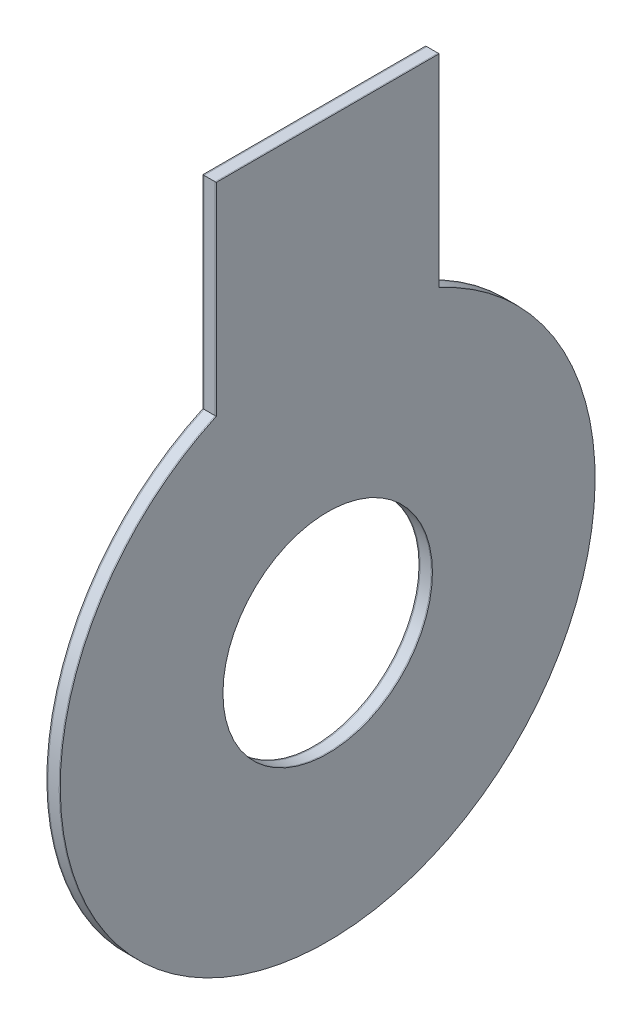
ISO-10303-21;
HEADER;
FILE_DESCRIPTION(('STEP AP214'),'2;1');
FILE_NAME('part.step','',(''),(''),'','','');
FILE_SCHEMA(('AUTOMOTIVE_DESIGN { 1 0 10303 214 1 1 1 1 }'));
ENDSEC;
DATA;
#1=APPLICATION_CONTEXT('core data for automotive mechanical design processes');
#2=APPLICATION_PROTOCOL_DEFINITION('international standard','automotive_design',2000,#1);
#3=PRODUCT_CONTEXT('',#1,'mechanical');
#4=PRODUCT('Part','Part','',(#3));
#5=PRODUCT_RELATED_PRODUCT_CATEGORY('part','',(#4));
#6=PRODUCT_DEFINITION_FORMATION('','',#4);
#7=PRODUCT_DEFINITION_CONTEXT('part definition',#1,'design');
#8=PRODUCT_DEFINITION('design','',#6,#7);
#9=PRODUCT_DEFINITION_SHAPE('','',#8);
#10=(LENGTH_UNIT() NAMED_UNIT(*) SI_UNIT(.MILLI.,.METRE.));
#11=(NAMED_UNIT(*) PLANE_ANGLE_UNIT() SI_UNIT($,.RADIAN.));
#12=(NAMED_UNIT(*) SI_UNIT($,.STERADIAN.) SOLID_ANGLE_UNIT());
#13=UNCERTAINTY_MEASURE_WITH_UNIT(LENGTH_MEASURE(1.E-05),#10,'distance_accuracy_value','');
#14=(GEOMETRIC_REPRESENTATION_CONTEXT(3) GLOBAL_UNCERTAINTY_ASSIGNED_CONTEXT((#13)) GLOBAL_UNIT_ASSIGNED_CONTEXT((#10,
#11,#12)) REPRESENTATION_CONTEXT('',''));
#15=CARTESIAN_POINT('',(0.,0.,0.));
#16=DIRECTION('',(0.,0.,1.));
#17=DIRECTION('',(1.,0.,0.));
#18=AXIS2_PLACEMENT_3D('',#15,#16,#17);
#19=CARTESIAN_POINT('',(-2.75,0.,0.));
#20=DIRECTION('',(-1.,0.,0.));
#21=DIRECTION('',(0.,0.,1.));
#22=AXIS2_PLACEMENT_3D('',#19,#20,#21);
#23=PLANE('',#22);
#24=CARTESIAN_POINT('',(-2.75,0.,0.));
#25=DIRECTION('',(-1.,0.,0.));
#26=DIRECTION('',(0.,0.,1.));
#27=AXIS2_PLACEMENT_3D('',#24,#25,#26);
#28=CIRCLE('',#27,60.);
#29=CARTESIAN_POINT('',(-2.75,54.5435605731786,-25.));
#30=VERTEX_POINT('',#29);
#31=CARTESIAN_POINT('',(-2.75,54.5435605731786,25.));
#32=VERTEX_POINT('',#31);
#33=EDGE_CURVE('E108',#30,#32,#28,.T.);
#34=ORIENTED_EDGE('',*,*,#33,.T.);
#35=DIRECTION('',(0.,1.,0.));
#36=VECTOR('',#35,1.);
#37=CARTESIAN_POINT('',(-2.75,54.5435605731786,25.));
#38=LINE('',#37,#36);
#39=CARTESIAN_POINT('',(-2.75,100.,25.));
#40=VERTEX_POINT('',#39);
#41=EDGE_CURVE('E103',#32,#40,#38,.T.);
#42=ORIENTED_EDGE('',*,*,#41,.T.);
#43=DIRECTION('',(0.,0.,-1.));
#44=VECTOR('',#43,1.);
#45=CARTESIAN_POINT('',(-2.75,100.,25.));
#46=LINE('',#45,#44);
#47=CARTESIAN_POINT('',(-2.75,100.,-25.));
#48=VERTEX_POINT('',#47);
#49=EDGE_CURVE('E106',#40,#48,#46,.T.);
#50=ORIENTED_EDGE('',*,*,#49,.T.);
#51=DIRECTION('',(0.,-1.,0.));
#52=VECTOR('',#51,1.);
#53=CARTESIAN_POINT('',(-2.75,100.,-25.));
#54=LINE('',#53,#52);
#55=EDGE_CURVE('E73',#48,#30,#54,.T.);
#56=ORIENTED_EDGE('',*,*,#55,.T.);
#57=EDGE_LOOP('',(#34,#42,#50,#56));
#58=FACE_BOUND('',#57,.T.);
#59=CARTESIAN_POINT('',(-2.75,0.,0.));
#60=DIRECTION('',(-1.,0.,0.));
#61=DIRECTION('',(0.,0.,1.));
#62=AXIS2_PLACEMENT_3D('',#59,#60,#61);
#63=CIRCLE('',#62,23.5);
#64=CARTESIAN_POINT('',(-2.75,0.,23.5));
#65=VERTEX_POINT('',#64);
#66=EDGE_CURVE('E123',#65,#65,#63,.T.);
#67=ORIENTED_EDGE('',*,*,#66,.F.);
#68=EDGE_LOOP('',(#67));
#69=FACE_BOUND('',#68,.T.);
#70=ADVANCED_FACE('F56',(#58,#69),#23,.T.);
#71=CARTESIAN_POINT('',(-2.5,0.,0.));
#72=DIRECTION('',(-1.,0.,0.));
#73=DIRECTION('',(0.,0.,1.));
#74=AXIS2_PLACEMENT_3D('',#71,#72,#73);
#75=PLANE('',#74);
#76=CARTESIAN_POINT('',(-2.5,0.,0.));
#77=DIRECTION('',(-1.,0.,0.));
#78=DIRECTION('',(0.,0.,1.));
#79=AXIS2_PLACEMENT_3D('',#76,#77,#78);
#80=CIRCLE('',#79,60.);
#81=CARTESIAN_POINT('',(-2.5,54.5435605731786,-25.));
#82=VERTEX_POINT('',#81);
#83=CARTESIAN_POINT('',(-2.5,54.5435605731786,25.));
#84=VERTEX_POINT('',#83);
#85=EDGE_CURVE('E120',#82,#84,#80,.T.);
#86=ORIENTED_EDGE('',*,*,#85,.F.);
#87=DIRECTION('',(0.,-1.,0.));
#88=VECTOR('',#87,1.);
#89=CARTESIAN_POINT('',(-2.5,100.,-25.));
#90=LINE('',#89,#88);
#91=CARTESIAN_POINT('',(-2.5,100.,-25.));
#92=VERTEX_POINT('',#91);
#93=EDGE_CURVE('E96',#92,#82,#90,.T.);
#94=ORIENTED_EDGE('',*,*,#93,.F.);
#95=DIRECTION('',(0.,0.,-1.));
#96=VECTOR('',#95,1.);
#97=CARTESIAN_POINT('',(-2.5,100.,25.));
#98=LINE('',#97,#96);
#99=CARTESIAN_POINT('',(-2.5,100.,25.));
#100=VERTEX_POINT('',#99);
#101=EDGE_CURVE('E90',#100,#92,#98,.T.);
#102=ORIENTED_EDGE('',*,*,#101,.F.);
#103=DIRECTION('',(0.,1.,0.));
#104=VECTOR('',#103,1.);
#105=CARTESIAN_POINT('',(-2.5,54.5435605731786,25.));
#106=LINE('',#105,#104);
#107=EDGE_CURVE('E112',#84,#100,#106,.T.);
#108=ORIENTED_EDGE('',*,*,#107,.F.);
#109=EDGE_LOOP('',(#86,#94,#102,#108));
#110=FACE_BOUND('',#109,.T.);
#111=CARTESIAN_POINT('',(-2.5,0.,0.));
#112=DIRECTION('',(-1.,0.,0.));
#113=DIRECTION('',(0.,0.,1.));
#114=AXIS2_PLACEMENT_3D('',#111,#112,#113);
#115=CIRCLE('',#114,23.5);
#116=CARTESIAN_POINT('',(-2.5,0.,23.5));
#117=VERTEX_POINT('',#116);
#118=EDGE_CURVE('E135',#117,#117,#115,.T.);
#119=ORIENTED_EDGE('',*,*,#118,.T.);
#120=EDGE_LOOP('',(#119));
#121=FACE_BOUND('',#120,.T.);
#122=ADVANCED_FACE('F131',(#110,#121),#75,.F.);
#123=CARTESIAN_POINT('',(-2.75,0.,0.));
#124=DIRECTION('',(1.,0.,0.));
#125=DIRECTION('',(0.,0.,-1.));
#126=AXIS2_PLACEMENT_3D('',#123,#124,#125);
#127=CYLINDRICAL_SURFACE('',#126,60.);
#128=ORIENTED_EDGE('',*,*,#85,.T.);
#129=DIRECTION('',(1.,0.,0.));
#130=VECTOR('',#129,1.);
#131=CARTESIAN_POINT('',(-2.75,54.5435605731786,25.));
#132=LINE('',#131,#130);
#133=EDGE_CURVE('E12',#32,#84,#132,.T.);
#134=ORIENTED_EDGE('',*,*,#133,.F.);
#135=ORIENTED_EDGE('',*,*,#33,.F.);
#136=DIRECTION('',(1.,0.,0.));
#137=VECTOR('',#136,1.);
#138=CARTESIAN_POINT('',(-2.75,54.5435605731786,-25.));
#139=LINE('',#138,#137);
#140=EDGE_CURVE('E116',#30,#82,#139,.T.);
#141=ORIENTED_EDGE('',*,*,#140,.T.);
#142=EDGE_LOOP('',(#128,#134,#135,#141));
#143=FACE_BOUND('',#142,.T.);
#144=ADVANCED_FACE('F58',(#143),#127,.T.);
#145=CARTESIAN_POINT('',(-2.75,54.5435605731786,25.));
#146=DIRECTION('',(0.,0.,-1.));
#147=DIRECTION('',(0.,1.,0.));
#148=AXIS2_PLACEMENT_3D('',#145,#146,#147);
#149=PLANE('',#148);
#150=ORIENTED_EDGE('',*,*,#107,.T.);
#151=DIRECTION('',(1.,0.,0.));
#152=VECTOR('',#151,1.);
#153=CARTESIAN_POINT('',(-2.75,100.,25.));
#154=LINE('',#153,#152);
#155=EDGE_CURVE('E65',#40,#100,#154,.T.);
#156=ORIENTED_EDGE('',*,*,#155,.F.);
#157=ORIENTED_EDGE('',*,*,#41,.F.);
#158=ORIENTED_EDGE('',*,*,#133,.T.);
#159=EDGE_LOOP('',(#150,#156,#157,#158));
#160=FACE_BOUND('',#159,.T.);
#161=ADVANCED_FACE('F111',(#160),#149,.F.);
#162=CARTESIAN_POINT('',(-2.75,100.,25.));
#163=DIRECTION('',(0.,-1.,0.));
#164=DIRECTION('',(0.,0.,-1.));
#165=AXIS2_PLACEMENT_3D('',#162,#163,#164);
#166=PLANE('',#165);
#167=ORIENTED_EDGE('',*,*,#101,.T.);
#168=DIRECTION('',(1.,0.,0.));
#169=VECTOR('',#168,1.);
#170=CARTESIAN_POINT('',(-2.75,100.,-25.));
#171=LINE('',#170,#169);
#172=EDGE_CURVE('E113',#48,#92,#171,.T.);
#173=ORIENTED_EDGE('',*,*,#172,.F.);
#174=ORIENTED_EDGE('',*,*,#49,.F.);
#175=ORIENTED_EDGE('',*,*,#155,.T.);
#176=EDGE_LOOP('',(#167,#173,#174,#175));
#177=FACE_BOUND('',#176,.T.);
#178=ADVANCED_FACE('F114',(#177),#166,.F.);
#179=CARTESIAN_POINT('',(-2.75,100.,-25.));
#180=DIRECTION('',(0.,0.,1.));
#181=DIRECTION('',(0.,-1.,0.));
#182=AXIS2_PLACEMENT_3D('',#179,#180,#181);
#183=PLANE('',#182);
#184=ORIENTED_EDGE('',*,*,#93,.T.);
#185=ORIENTED_EDGE('',*,*,#140,.F.);
#186=ORIENTED_EDGE('',*,*,#55,.F.);
#187=ORIENTED_EDGE('',*,*,#172,.T.);
#188=EDGE_LOOP('',(#184,#185,#186,#187));
#189=FACE_BOUND('',#188,.T.);
#190=ADVANCED_FACE('F128',(#189),#183,.F.);
#191=CARTESIAN_POINT('',(-2.75,0.,0.));
#192=DIRECTION('',(1.,0.,0.));
#193=DIRECTION('',(0.,0.,-1.));
#194=AXIS2_PLACEMENT_3D('',#191,#192,#193);
#195=CYLINDRICAL_SURFACE('',#194,23.5);
#196=ORIENTED_EDGE('',*,*,#66,.T.);
#197=EDGE_LOOP('',(#196));
#198=FACE_BOUND('',#197,.T.);
#199=ORIENTED_EDGE('',*,*,#118,.F.);
#200=EDGE_LOOP('',(#199));
#201=FACE_BOUND('',#200,.T.);
#202=ADVANCED_FACE('F141',(#198,#201),#195,.F.);
#203=CLOSED_SHELL('',(#70,#122,#144,#161,#178,#190,#202));
#204=MANIFOLD_SOLID_BREP('B2',#203);
#205=CARTESIAN_POINT('',(-2.5,0.,0.));
#206=DIRECTION('',(-1.,0.,0.));
#207=DIRECTION('',(0.,0.,1.));
#208=AXIS2_PLACEMENT_3D('',#205,#206,#207);
#209=PLANE('',#208);
#210=CARTESIAN_POINT('',(-2.5,0.,0.));
#211=DIRECTION('',(-1.,0.,0.));
#212=DIRECTION('',(0.,0.,1.));
#213=AXIS2_PLACEMENT_3D('',#210,#211,#212);
#214=CIRCLE('',#213,60.);
#215=CARTESIAN_POINT('',(-2.5,54.5435605731786,-25.));
#216=VERTEX_POINT('',#215);
#217=CARTESIAN_POINT('',(-2.5,54.5435605731786,25.));
#218=VERTEX_POINT('',#217);
#219=EDGE_CURVE('E262',#216,#218,#214,.T.);
#220=ORIENTED_EDGE('',*,*,#219,.T.);
#221=DIRECTION('',(0.,1.,0.));
#222=VECTOR('',#221,1.);
#223=CARTESIAN_POINT('',(-2.5,54.5435605731786,25.));
#224=LINE('',#223,#222);
#225=CARTESIAN_POINT('',(-2.5,100.,25.));
#226=VERTEX_POINT('',#225);
#227=EDGE_CURVE('E257',#218,#226,#224,.T.);
#228=ORIENTED_EDGE('',*,*,#227,.T.);
#229=DIRECTION('',(0.,0.,-1.));
#230=VECTOR('',#229,1.);
#231=CARTESIAN_POINT('',(-2.5,100.,25.));
#232=LINE('',#231,#230);
#233=CARTESIAN_POINT('',(-2.5,100.,-25.));
#234=VERTEX_POINT('',#233);
#235=EDGE_CURVE('E260',#226,#234,#232,.T.);
#236=ORIENTED_EDGE('',*,*,#235,.T.);
#237=DIRECTION('',(0.,-1.,0.));
#238=VECTOR('',#237,1.);
#239=CARTESIAN_POINT('',(-2.5,100.,-25.));
#240=LINE('',#239,#238);
#241=EDGE_CURVE('E227',#234,#216,#240,.T.);
#242=ORIENTED_EDGE('',*,*,#241,.T.);
#243=EDGE_LOOP('',(#220,#228,#236,#242));
#244=FACE_BOUND('',#243,.T.);
#245=CARTESIAN_POINT('',(-2.5,0.,0.));
#246=DIRECTION('',(-1.,0.,0.));
#247=DIRECTION('',(0.,0.,1.));
#248=AXIS2_PLACEMENT_3D('',#245,#246,#247);
#249=CIRCLE('',#248,23.5);
#250=CARTESIAN_POINT('',(-2.5,0.,23.5));
#251=VERTEX_POINT('',#250);
#252=EDGE_CURVE('E277',#251,#251,#249,.T.);
#253=ORIENTED_EDGE('',*,*,#252,.F.);
#254=EDGE_LOOP('',(#253));
#255=FACE_BOUND('',#254,.T.);
#256=ADVANCED_FACE('F210',(#244,#255),#209,.T.);
#257=CARTESIAN_POINT('',(0.,0.,0.));
#258=DIRECTION('',(-1.,0.,0.));
#259=DIRECTION('',(0.,0.,1.));
#260=AXIS2_PLACEMENT_3D('',#257,#258,#259);
#261=PLANE('',#260);
#262=CARTESIAN_POINT('',(0.,0.,0.));
#263=DIRECTION('',(-1.,0.,0.));
#264=DIRECTION('',(0.,0.,1.));
#265=AXIS2_PLACEMENT_3D('',#262,#263,#264);
#266=CIRCLE('',#265,60.);
#267=CARTESIAN_POINT('',(0.,54.5435605731786,-25.));
#268=VERTEX_POINT('',#267);
#269=CARTESIAN_POINT('',(0.,54.5435605731786,25.));
#270=VERTEX_POINT('',#269);
#271=EDGE_CURVE('E274',#268,#270,#266,.T.);
#272=ORIENTED_EDGE('',*,*,#271,.F.);
#273=DIRECTION('',(0.,-1.,0.));
#274=VECTOR('',#273,1.);
#275=CARTESIAN_POINT('',(0.,100.,-25.));
#276=LINE('',#275,#274);
#277=CARTESIAN_POINT('',(0.,100.,-25.));
#278=VERTEX_POINT('',#277);
#279=EDGE_CURVE('E250',#278,#268,#276,.T.);
#280=ORIENTED_EDGE('',*,*,#279,.F.);
#281=DIRECTION('',(0.,0.,-1.));
#282=VECTOR('',#281,1.);
#283=CARTESIAN_POINT('',(0.,100.,25.));
#284=LINE('',#283,#282);
#285=CARTESIAN_POINT('',(0.,100.,25.));
#286=VERTEX_POINT('',#285);
#287=EDGE_CURVE('E244',#286,#278,#284,.T.);
#288=ORIENTED_EDGE('',*,*,#287,.F.);
#289=DIRECTION('',(0.,1.,0.));
#290=VECTOR('',#289,1.);
#291=CARTESIAN_POINT('',(0.,54.5435605731786,25.));
#292=LINE('',#291,#290);
#293=EDGE_CURVE('E266',#270,#286,#292,.T.);
#294=ORIENTED_EDGE('',*,*,#293,.F.);
#295=EDGE_LOOP('',(#272,#280,#288,#294));
#296=FACE_BOUND('',#295,.T.);
#297=CARTESIAN_POINT('',(0.,0.,0.));
#298=DIRECTION('',(-1.,0.,0.));
#299=DIRECTION('',(0.,0.,1.));
#300=AXIS2_PLACEMENT_3D('',#297,#298,#299);
#301=CIRCLE('',#300,23.5);
#302=CARTESIAN_POINT('',(0.,0.,23.5));
#303=VERTEX_POINT('',#302);
#304=EDGE_CURVE('E289',#303,#303,#301,.T.);
#305=ORIENTED_EDGE('',*,*,#304,.T.);
#306=EDGE_LOOP('',(#305));
#307=FACE_BOUND('',#306,.T.);
#308=ADVANCED_FACE('F285',(#296,#307),#261,.F.);
#309=CARTESIAN_POINT('',(-2.5,0.,0.));
#310=DIRECTION('',(1.,0.,0.));
#311=DIRECTION('',(0.,0.,-1.));
#312=AXIS2_PLACEMENT_3D('',#309,#310,#311);
#313=CYLINDRICAL_SURFACE('',#312,60.);
#314=ORIENTED_EDGE('',*,*,#271,.T.);
#315=DIRECTION('',(1.,0.,0.));
#316=VECTOR('',#315,1.);
#317=CARTESIAN_POINT('',(-2.5,54.5435605731786,25.));
#318=LINE('',#317,#316);
#319=EDGE_CURVE('E54',#218,#270,#318,.T.);
#320=ORIENTED_EDGE('',*,*,#319,.F.);
#321=ORIENTED_EDGE('',*,*,#219,.F.);
#322=DIRECTION('',(1.,0.,0.));
#323=VECTOR('',#322,1.);
#324=CARTESIAN_POINT('',(-2.5,54.5435605731786,-25.));
#325=LINE('',#324,#323);
#326=EDGE_CURVE('E270',#216,#268,#325,.T.);
#327=ORIENTED_EDGE('',*,*,#326,.T.);
#328=EDGE_LOOP('',(#314,#320,#321,#327));
#329=FACE_BOUND('',#328,.T.);
#330=ADVANCED_FACE('F212',(#329),#313,.T.);
#331=CARTESIAN_POINT('',(-2.5,54.5435605731786,25.));
#332=DIRECTION('',(0.,0.,-1.));
#333=DIRECTION('',(0.,1.,0.));
#334=AXIS2_PLACEMENT_3D('',#331,#332,#333);
#335=PLANE('',#334);
#336=ORIENTED_EDGE('',*,*,#293,.T.);
#337=DIRECTION('',(1.,0.,0.));
#338=VECTOR('',#337,1.);
#339=CARTESIAN_POINT('',(-2.5,100.,25.));
#340=LINE('',#339,#338);
#341=EDGE_CURVE('E219',#226,#286,#340,.T.);
#342=ORIENTED_EDGE('',*,*,#341,.F.);
#343=ORIENTED_EDGE('',*,*,#227,.F.);
#344=ORIENTED_EDGE('',*,*,#319,.T.);
#345=EDGE_LOOP('',(#336,#342,#343,#344));
#346=FACE_BOUND('',#345,.T.);
#347=ADVANCED_FACE('F265',(#346),#335,.F.);
#348=CARTESIAN_POINT('',(-2.5,100.,25.));
#349=DIRECTION('',(0.,-1.,0.));
#350=DIRECTION('',(0.,0.,-1.));
#351=AXIS2_PLACEMENT_3D('',#348,#349,#350);
#352=PLANE('',#351);
#353=ORIENTED_EDGE('',*,*,#287,.T.);
#354=DIRECTION('',(1.,0.,0.));
#355=VECTOR('',#354,1.);
#356=CARTESIAN_POINT('',(-2.5,100.,-25.));
#357=LINE('',#356,#355);
#358=EDGE_CURVE('E267',#234,#278,#357,.T.);
#359=ORIENTED_EDGE('',*,*,#358,.F.);
#360=ORIENTED_EDGE('',*,*,#235,.F.);
#361=ORIENTED_EDGE('',*,*,#341,.T.);
#362=EDGE_LOOP('',(#353,#359,#360,#361));
#363=FACE_BOUND('',#362,.T.);
#364=ADVANCED_FACE('F268',(#363),#352,.F.);
#365=CARTESIAN_POINT('',(-2.5,100.,-25.));
#366=DIRECTION('',(0.,0.,1.));
#367=DIRECTION('',(0.,-1.,0.));
#368=AXIS2_PLACEMENT_3D('',#365,#366,#367);
#369=PLANE('',#368);
#370=ORIENTED_EDGE('',*,*,#279,.T.);
#371=ORIENTED_EDGE('',*,*,#326,.F.);
#372=ORIENTED_EDGE('',*,*,#241,.F.);
#373=ORIENTED_EDGE('',*,*,#358,.T.);
#374=EDGE_LOOP('',(#370,#371,#372,#373));
#375=FACE_BOUND('',#374,.T.);
#376=ADVANCED_FACE('F282',(#375),#369,.F.);
#377=CARTESIAN_POINT('',(-2.5,0.,0.));
#378=DIRECTION('',(1.,0.,0.));
#379=DIRECTION('',(0.,0.,-1.));
#380=AXIS2_PLACEMENT_3D('',#377,#378,#379);
#381=CYLINDRICAL_SURFACE('',#380,23.5);
#382=ORIENTED_EDGE('',*,*,#252,.T.);
#383=EDGE_LOOP('',(#382));
#384=FACE_BOUND('',#383,.T.);
#385=ORIENTED_EDGE('',*,*,#304,.F.);
#386=EDGE_LOOP('',(#385));
#387=FACE_BOUND('',#386,.T.);
#388=ADVANCED_FACE('F295',(#384,#387),#381,.F.);
#389=CLOSED_SHELL('',(#256,#308,#330,#347,#364,#376,#388));
#390=MANIFOLD_SOLID_BREP('B6',#389);
#391=CARTESIAN_POINT('',(0.25,0.,25.));
#392=DIRECTION('',(0.,0.,-1.));
#393=DIRECTION('',(0.,1.,0.));
#394=AXIS2_PLACEMENT_3D('',#391,#392,#393);
#395=PLANE('',#394);
#396=DIRECTION('',(0.,-1.,0.));
#397=VECTOR('',#396,1.);
#398=CARTESIAN_POINT('',(0.,0.,25.));
#399=LINE('',#398,#397);
#400=CARTESIAN_POINT('',(0.,100.,25.));
#401=VERTEX_POINT('',#400);
#402=CARTESIAN_POINT('',(0.,54.5435605731786,25.));
#403=VERTEX_POINT('',#402);
#404=EDGE_CURVE('E422',#401,#403,#399,.T.);
#405=ORIENTED_EDGE('',*,*,#404,.T.);
#406=DIRECTION('',(-1.,0.,0.));
#407=VECTOR('',#406,1.);
#408=CARTESIAN_POINT('',(0.25,54.5435605731786,25.));
#409=LINE('',#408,#407);
#410=CARTESIAN_POINT('',(0.25,54.5435605731786,25.));
#411=VERTEX_POINT('',#410);
#412=EDGE_CURVE('E208',#411,#403,#409,.T.);
#413=ORIENTED_EDGE('',*,*,#412,.F.);
#414=DIRECTION('',(0.,-1.,0.));
#415=VECTOR('',#414,1.);
#416=CARTESIAN_POINT('',(0.25,0.,25.));
#417=LINE('',#416,#415);
#418=CARTESIAN_POINT('',(0.25,100.,25.));
#419=VERTEX_POINT('',#418);
#420=EDGE_CURVE('E405',#419,#411,#417,.T.);
#421=ORIENTED_EDGE('',*,*,#420,.F.);
#422=DIRECTION('',(-1.,0.,0.));
#423=VECTOR('',#422,1.);
#424=CARTESIAN_POINT('',(0.25,100.,25.));
#425=LINE('',#424,#423);
#426=EDGE_CURVE('E371',#419,#401,#425,.T.);
#427=ORIENTED_EDGE('',*,*,#426,.T.);
#428=EDGE_LOOP('',(#405,#413,#421,#427));
#429=FACE_BOUND('',#428,.T.);
#430=ADVANCED_FACE('F355',(#429),#395,.F.);
#431=CARTESIAN_POINT('',(0.25,0.,0.));
#432=DIRECTION('',(-1.,0.,0.));
#433=DIRECTION('',(0.,0.,1.));
#434=AXIS2_PLACEMENT_3D('',#431,#432,#433);
#435=CYLINDRICAL_SURFACE('',#434,60.);
#436=CARTESIAN_POINT('',(0.,0.,0.));
#437=DIRECTION('',(1.,0.,0.));
#438=DIRECTION('',(0.,0.,-1.));
#439=AXIS2_PLACEMENT_3D('',#436,#437,#438);
#440=CIRCLE('',#439,60.);
#441=CARTESIAN_POINT('',(0.,54.5435605731786,-25.));
#442=VERTEX_POINT('',#441);
#443=EDGE_CURVE('E410',#403,#442,#440,.T.);
#444=ORIENTED_EDGE('',*,*,#443,.T.);
#445=DIRECTION('',(-1.,0.,0.));
#446=VECTOR('',#445,1.);
#447=CARTESIAN_POINT('',(0.25,54.5435605731786,-25.));
#448=LINE('',#447,#446);
#449=CARTESIAN_POINT('',(0.25,54.5435605731786,-25.));
#450=VERTEX_POINT('',#449);
#451=EDGE_CURVE('E363',#450,#442,#448,.T.);
#452=ORIENTED_EDGE('',*,*,#451,.F.);
#453=CARTESIAN_POINT('',(0.25,0.,0.));
#454=DIRECTION('',(1.,0.,0.));
#455=DIRECTION('',(0.,0.,-1.));
#456=AXIS2_PLACEMENT_3D('',#453,#454,#455);
#457=CIRCLE('',#456,60.);
#458=EDGE_CURVE('E396',#411,#450,#457,.T.);
#459=ORIENTED_EDGE('',*,*,#458,.F.);
#460=ORIENTED_EDGE('',*,*,#412,.T.);
#461=EDGE_LOOP('',(#444,#452,#459,#460));
#462=FACE_BOUND('',#461,.T.);
#463=ADVANCED_FACE('F409',(#462),#435,.T.);
#464=CARTESIAN_POINT('',(0.25,0.,-25.));
#465=DIRECTION('',(0.,0.,-1.));
#466=DIRECTION('',(0.,1.,0.));
#467=AXIS2_PLACEMENT_3D('',#464,#465,#466);
#468=PLANE('',#467);
#469=DIRECTION('',(0.,-1.,0.));
#470=VECTOR('',#469,1.);
#471=CARTESIAN_POINT('',(0.,0.,-25.));
#472=LINE('',#471,#470);
#473=CARTESIAN_POINT('',(0.,100.,-25.));
#474=VERTEX_POINT('',#473);
#475=EDGE_CURVE('E425',#474,#442,#472,.T.);
#476=ORIENTED_EDGE('',*,*,#475,.F.);
#477=DIRECTION('',(-1.,0.,0.));
#478=VECTOR('',#477,1.);
#479=CARTESIAN_POINT('',(0.25,100.,-25.));
#480=LINE('',#479,#478);
#481=CARTESIAN_POINT('',(0.25,100.,-25.));
#482=VERTEX_POINT('',#481);
#483=EDGE_CURVE('E385',#482,#474,#480,.T.);
#484=ORIENTED_EDGE('',*,*,#483,.F.);
#485=DIRECTION('',(0.,-1.,0.));
#486=VECTOR('',#485,1.);
#487=CARTESIAN_POINT('',(0.25,0.,-25.));
#488=LINE('',#487,#486);
#489=EDGE_CURVE('E404',#482,#450,#488,.T.);
#490=ORIENTED_EDGE('',*,*,#489,.T.);
#491=ORIENTED_EDGE('',*,*,#451,.T.);
#492=EDGE_LOOP('',(#476,#484,#490,#491));
#493=FACE_BOUND('',#492,.T.);
#494=ADVANCED_FACE('F413',(#493),#468,.T.);
#495=CARTESIAN_POINT('',(0.25,100.,0.));
#496=DIRECTION('',(0.,1.,0.));
#497=DIRECTION('',(0.,0.,1.));
#498=AXIS2_PLACEMENT_3D('',#495,#496,#497);
#499=PLANE('',#498);
#500=DIRECTION('',(0.,0.,-1.));
#501=VECTOR('',#500,1.);
#502=CARTESIAN_POINT('',(0.,100.,0.));
#503=LINE('',#502,#501);
#504=EDGE_CURVE('E427',#401,#474,#503,.T.);
#505=ORIENTED_EDGE('',*,*,#504,.F.);
#506=ORIENTED_EDGE('',*,*,#426,.F.);
#507=DIRECTION('',(0.,0.,-1.));
#508=VECTOR('',#507,1.);
#509=CARTESIAN_POINT('',(0.25,100.,0.));
#510=LINE('',#509,#508);
#511=EDGE_CURVE('E414',#419,#482,#510,.T.);
#512=ORIENTED_EDGE('',*,*,#511,.T.);
#513=ORIENTED_EDGE('',*,*,#483,.T.);
#514=EDGE_LOOP('',(#505,#506,#512,#513));
#515=FACE_BOUND('',#514,.T.);
#516=ADVANCED_FACE('F440',(#515),#499,.T.);
#517=CARTESIAN_POINT('',(0.25,0.,0.));
#518=DIRECTION('',(-1.,0.,0.));
#519=DIRECTION('',(0.,0.,1.));
#520=AXIS2_PLACEMENT_3D('',#517,#518,#519);
#521=CYLINDRICAL_SURFACE('',#520,23.5);
#522=CARTESIAN_POINT('',(0.25,0.,0.));
#523=DIRECTION('',(1.,0.,0.));
#524=DIRECTION('',(0.,0.,-1.));
#525=AXIS2_PLACEMENT_3D('',#522,#523,#524);
#526=CIRCLE('',#525,23.5);
#527=CARTESIAN_POINT('',(0.25,0.,-23.5));
#528=VERTEX_POINT('',#527);
#529=EDGE_CURVE('E416',#528,#528,#526,.T.);
#530=ORIENTED_EDGE('',*,*,#529,.T.);
#531=EDGE_LOOP('',(#530));
#532=FACE_BOUND('',#531,.T.);
#533=CARTESIAN_POINT('',(0.,0.,0.));
#534=DIRECTION('',(1.,0.,0.));
#535=DIRECTION('',(0.,0.,-1.));
#536=AXIS2_PLACEMENT_3D('',#533,#534,#535);
#537=CIRCLE('',#536,23.5);
#538=CARTESIAN_POINT('',(0.,0.,-23.5));
#539=VERTEX_POINT('',#538);
#540=EDGE_CURVE('E430',#539,#539,#537,.T.);
#541=ORIENTED_EDGE('',*,*,#540,.F.);
#542=EDGE_LOOP('',(#541));
#543=FACE_BOUND('',#542,.T.);
#544=ADVANCED_FACE('F438',(#532,#543),#521,.F.);
#545=CARTESIAN_POINT('',(0.25,0.,0.));
#546=DIRECTION('',(1.,0.,0.));
#547=DIRECTION('',(0.,0.,-1.));
#548=AXIS2_PLACEMENT_3D('',#545,#546,#547);
#549=PLANE('',#548);
#550=ORIENTED_EDGE('',*,*,#420,.T.);
#551=ORIENTED_EDGE('',*,*,#458,.T.);
#552=ORIENTED_EDGE('',*,*,#489,.F.);
#553=ORIENTED_EDGE('',*,*,#511,.F.);
#554=EDGE_LOOP('',(#550,#551,#552,#553));
#555=FACE_BOUND('',#554,.T.);
#556=ORIENTED_EDGE('',*,*,#529,.F.);
#557=EDGE_LOOP('',(#556));
#558=FACE_BOUND('',#557,.T.);
#559=ADVANCED_FACE('F400',(#555,#558),#549,.T.);
#560=CARTESIAN_POINT('',(0.,0.,0.));
#561=DIRECTION('',(1.,0.,0.));
#562=DIRECTION('',(0.,0.,-1.));
#563=AXIS2_PLACEMENT_3D('',#560,#561,#562);
#564=PLANE('',#563);
#565=ORIENTED_EDGE('',*,*,#404,.F.);
#566=ORIENTED_EDGE('',*,*,#504,.T.);
#567=ORIENTED_EDGE('',*,*,#475,.T.);
#568=ORIENTED_EDGE('',*,*,#443,.F.);
#569=EDGE_LOOP('',(#565,#566,#567,#568));
#570=FACE_BOUND('',#569,.T.);
#571=ORIENTED_EDGE('',*,*,#540,.T.);
#572=EDGE_LOOP('',(#571));
#573=FACE_BOUND('',#572,.T.);
#574=ADVANCED_FACE('F436',(#570,#573),#564,.F.);
#575=CLOSED_SHELL('',(#430,#463,#494,#516,#544,#559,#574));
#576=MANIFOLD_SOLID_BREP('B48',#575);
#577=ADVANCED_BREP_SHAPE_REPRESENTATION('',(#18,#204,#390,#576),#14);
#578=SHAPE_DEFINITION_REPRESENTATION(#9,#577);
ENDSEC;
END-ISO-10303-21;
